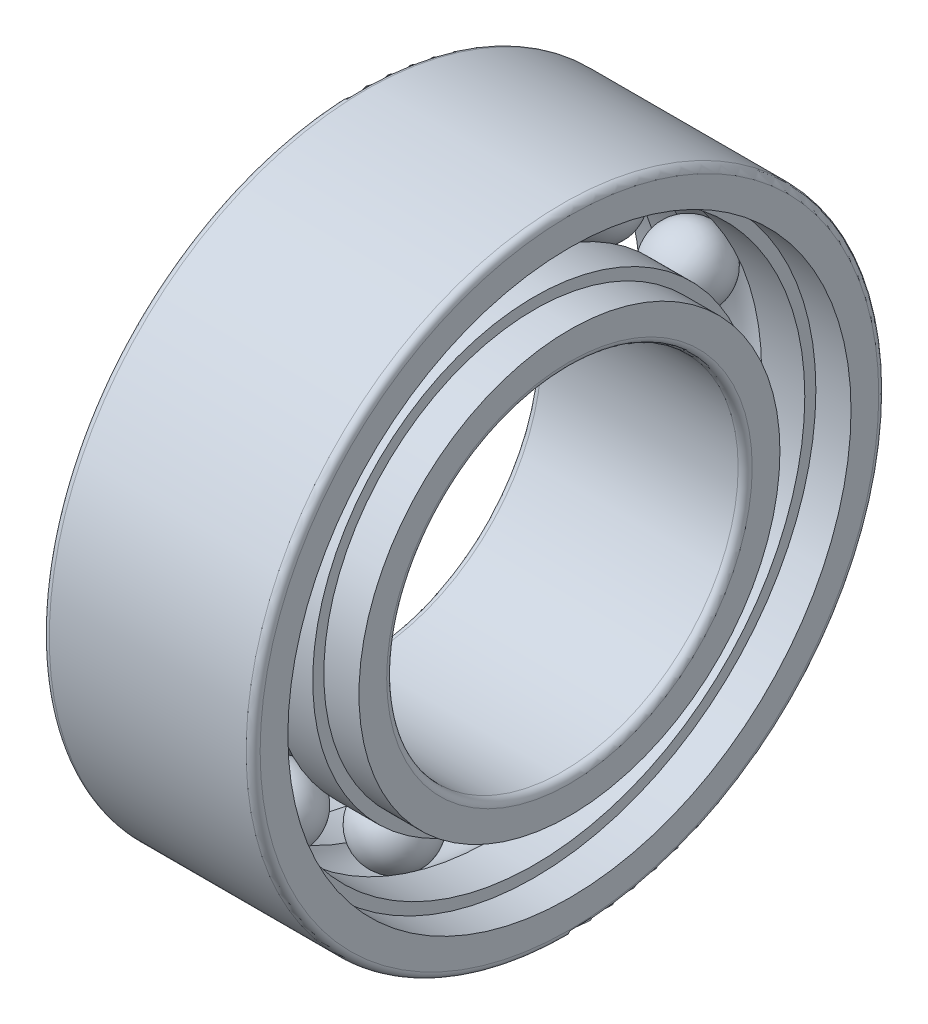
ISO-10303-21;
HEADER;
FILE_DESCRIPTION(('STEP AP214'),'2;1');
FILE_NAME('part.step','',(''),(''),'','','');
FILE_SCHEMA(('AUTOMOTIVE_DESIGN { 1 0 10303 214 1 1 1 1 }'));
ENDSEC;
DATA;
#1=APPLICATION_CONTEXT('core data for automotive mechanical design processes');
#2=APPLICATION_PROTOCOL_DEFINITION('international standard','automotive_design',2000,#1);
#3=PRODUCT_CONTEXT('',#1,'mechanical');
#4=PRODUCT('Part','Part','',(#3));
#5=PRODUCT_RELATED_PRODUCT_CATEGORY('part','',(#4));
#6=PRODUCT_DEFINITION_FORMATION('','',#4);
#7=PRODUCT_DEFINITION_CONTEXT('part definition',#1,'design');
#8=PRODUCT_DEFINITION('design','',#6,#7);
#9=PRODUCT_DEFINITION_SHAPE('','',#8);
#10=(LENGTH_UNIT() NAMED_UNIT(*) SI_UNIT(.MILLI.,.METRE.));
#11=(NAMED_UNIT(*) PLANE_ANGLE_UNIT() SI_UNIT($,.RADIAN.));
#12=(NAMED_UNIT(*) SI_UNIT($,.STERADIAN.) SOLID_ANGLE_UNIT());
#13=UNCERTAINTY_MEASURE_WITH_UNIT(LENGTH_MEASURE(1.E-05),#10,'distance_accuracy_value','');
#14=(GEOMETRIC_REPRESENTATION_CONTEXT(3) GLOBAL_UNCERTAINTY_ASSIGNED_CONTEXT((#13)) GLOBAL_UNIT_ASSIGNED_CONTEXT((#10,
#11,#12)) REPRESENTATION_CONTEXT('',''));
#15=CARTESIAN_POINT('',(0.,0.,0.));
#16=DIRECTION('',(0.,0.,1.));
#17=DIRECTION('',(1.,0.,0.));
#18=AXIS2_PLACEMENT_3D('',#15,#16,#17);
#19=CARTESIAN_POINT('',(1.5,-3.35822540765074,0.986063948945004));
#20=DIRECTION('',(1.,0.,0.));
#21=DIRECTION('',(0.,-0.959492973614497,0.28173255684143));
#22=AXIS2_PLACEMENT_3D('',#19,#20,#21);
#23=SPHERICAL_SURFACE('',#22,0.52);
#24=CARTESIAN_POINT('',(0.98,-3.35822540765074,0.986063948945004));
#25=VERTEX_POINT('',#24);
#26=VERTEX_LOOP('',#25);
#27=FACE_BOUND('',#26,.T.);
#28=CARTESIAN_POINT('',(2.02,-3.35822540765074,0.986063948945004));
#29=VERTEX_POINT('',#28);
#30=VERTEX_LOOP('',#29);
#31=FACE_BOUND('',#30,.T.);
#32=ADVANCED_FACE('P0_F16',(#27,#31),#23,.T.);
#33=OPEN_SHELL('',(#32));
#34=SHELL_BASED_SURFACE_MODEL('P0_B1',(#33));
#35=CARTESIAN_POINT('',(1.5,1.4539525455066,-3.18371198374082));
#36=DIRECTION('',(1.,0.,0.));
#37=DIRECTION('',(0.,0.415415013001886,-0.909631995354519));
#38=AXIS2_PLACEMENT_3D('',#35,#36,#37);
#39=SPHERICAL_SURFACE('',#38,0.52);
#40=CARTESIAN_POINT('',(0.98,1.4539525455066,-3.18371198374082));
#41=VERTEX_POINT('',#40);
#42=VERTEX_LOOP('',#41);
#43=FACE_BOUND('',#42,.T.);
#44=CARTESIAN_POINT('',(2.02,1.4539525455066,-3.18371198374082));
#45=VERTEX_POINT('',#44);
#46=VERTEX_LOOP('',#45);
#47=FACE_BOUND('',#46,.T.);
#48=ADVANCED_FACE('P1_F16',(#43,#47),#39,.T.);
#49=OPEN_SHELL('',(#48));
#50=SHELL_BASED_SURFACE_MODEL('P1_B1',(#49));
#51=CARTESIAN_POINT('',(1.5,2.94438736490914,-1.89224286109459));
#52=DIRECTION('',(1.,0.,0.));
#53=DIRECTION('',(0.,0.841253532831181,-0.540640817455598));
#54=AXIS2_PLACEMENT_3D('',#51,#52,#53);
#55=SPHERICAL_SURFACE('',#54,0.52);
#56=CARTESIAN_POINT('',(0.98,2.94438736490914,-1.89224286109459));
#57=VERTEX_POINT('',#56);
#58=VERTEX_LOOP('',#57);
#59=FACE_BOUND('',#58,.T.);
#60=CARTESIAN_POINT('',(2.02,2.94438736490914,-1.89224286109459));
#61=VERTEX_POINT('',#60);
#62=VERTEX_LOOP('',#61);
#63=FACE_BOUND('',#62,.T.);
#64=ADVANCED_FACE('P2_F16',(#59,#63),#55,.T.);
#65=OPEN_SHELL('',(#64));
#66=SHELL_BASED_SURFACE_MODEL('P2_B1',(#65));
#67=CARTESIAN_POINT('',(1.5,0.,0.));
#68=DIRECTION('',(1.,0.,0.));
#69=DIRECTION('',(0.,0.,-1.));
#70=AXIS2_PLACEMENT_3D('',#67,#68,#69);
#71=TOROIDAL_SURFACE('',#70,3.5,0.52);
#72=CARTESIAN_POINT('',(1.11361159437685,0.,0.));
#73=DIRECTION('',(1.,0.,0.));
#74=DIRECTION('',(0.,0.,-1.));
#75=AXIS2_PLACEMENT_3D('',#72,#73,#74);
#76=CIRCLE('',#75,3.848);
#77=CARTESIAN_POINT('',(1.11361159437685,0.,-3.848));
#78=VERTEX_POINT('',#77);
#79=EDGE_CURVE('P3_E144',#78,#78,#76,.F.);
#80=ORIENTED_EDGE('',*,*,#79,.T.);
#81=EDGE_LOOP('',(#80));
#82=FACE_BOUND('',#81,.T.);
#83=CARTESIAN_POINT('',(1.88638840562315,0.,0.));
#84=DIRECTION('',(1.,0.,0.));
#85=DIRECTION('',(0.,0.,-1.));
#86=AXIS2_PLACEMENT_3D('',#83,#84,#85);
#87=CIRCLE('',#86,3.84800000000001);
#88=CARTESIAN_POINT('',(1.88638840562315,0.,-3.84800000000001));
#89=VERTEX_POINT('',#88);
#90=EDGE_CURVE('P3_E141',#89,#89,#87,.T.);
#91=ORIENTED_EDGE('',*,*,#90,.T.);
#92=EDGE_LOOP('',(#91));
#93=FACE_BOUND('',#92,.T.);
#94=ADVANCED_FACE('P3_F15',(#82,#93),#71,.F.);
#95=CARTESIAN_POINT('',(0.806805797188427,0.,0.));
#96=DIRECTION('',(1.,0.,0.));
#97=DIRECTION('',(0.,0.,-1.));
#98=AXIS2_PLACEMENT_3D('',#95,#96,#97);
#99=CYLINDRICAL_SURFACE('',#98,3.848);
#100=ORIENTED_EDGE('',*,*,#79,.F.);
#101=EDGE_LOOP('',(#100));
#102=FACE_BOUND('',#101,.T.);
#103=CARTESIAN_POINT('',(0.500000000000002,0.,0.));
#104=DIRECTION('',(1.,0.,0.));
#105=DIRECTION('',(0.,0.,-1.));
#106=AXIS2_PLACEMENT_3D('',#103,#104,#105);
#107=CIRCLE('',#106,3.848);
#108=CARTESIAN_POINT('',(0.500000000000002,0.,-3.848));
#109=VERTEX_POINT('',#108);
#110=EDGE_CURVE('P3_E19',#109,#109,#107,.T.);
#111=ORIENTED_EDGE('',*,*,#110,.F.);
#112=EDGE_LOOP('',(#111));
#113=FACE_BOUND('',#112,.T.);
#114=ADVANCED_FACE('P3_F102',(#102,#113),#99,.F.);
#115=CARTESIAN_POINT('',(2.19319420281158,0.,0.));
#116=DIRECTION('',(1.,0.,0.));
#117=DIRECTION('',(0.,0.,-1.));
#118=AXIS2_PLACEMENT_3D('',#115,#116,#117);
#119=CYLINDRICAL_SURFACE('',#118,3.84800000000001);
#120=CARTESIAN_POINT('',(2.50000000000001,0.,0.));
#121=DIRECTION('',(1.,0.,0.));
#122=DIRECTION('',(0.,0.,-1.));
#123=AXIS2_PLACEMENT_3D('',#120,#121,#122);
#124=CIRCLE('',#123,3.84800000000001);
#125=CARTESIAN_POINT('',(2.50000000000001,0.,-3.84800000000001));
#126=VERTEX_POINT('',#125);
#127=EDGE_CURVE('P3_E137',#126,#126,#124,.F.);
#128=ORIENTED_EDGE('',*,*,#127,.F.);
#129=EDGE_LOOP('',(#128));
#130=FACE_BOUND('',#129,.T.);
#131=ORIENTED_EDGE('',*,*,#90,.F.);
#132=EDGE_LOOP('',(#131));
#133=FACE_BOUND('',#132,.T.);
#134=ADVANCED_FACE('P3_F99',(#130,#133),#119,.F.);
#135=CARTESIAN_POINT('',(0.500000000000002,3.9268,0.));
#136=DIRECTION('',(-1.,0.,0.));
#137=DIRECTION('',(0.,0.,1.));
#138=AXIS2_PLACEMENT_3D('',#135,#136,#137);
#139=PLANE('',#138);
#140=ORIENTED_EDGE('',*,*,#110,.T.);
#141=EDGE_LOOP('',(#140));
#142=FACE_BOUND('',#141,.T.);
#143=CARTESIAN_POINT('',(0.500000000000002,0.,0.));
#144=DIRECTION('',(1.,0.,0.));
#145=DIRECTION('',(0.,0.,-1.));
#146=AXIS2_PLACEMENT_3D('',#143,#144,#145);
#147=CIRCLE('',#146,4.0056);
#148=CARTESIAN_POINT('',(0.500000000000002,0.,-4.0056));
#149=VERTEX_POINT('',#148);
#150=EDGE_CURVE('P3_E135',#149,#149,#147,.F.);
#151=ORIENTED_EDGE('',*,*,#150,.T.);
#152=EDGE_LOOP('',(#151));
#153=FACE_BOUND('',#152,.T.);
#154=ADVANCED_FACE('P3_F95',(#142,#153),#139,.T.);
#155=CARTESIAN_POINT('',(2.50000000000001,3.9268,0.));
#156=DIRECTION('',(1.,0.,0.));
#157=DIRECTION('',(0.,0.,-1.));
#158=AXIS2_PLACEMENT_3D('',#155,#156,#157);
#159=PLANE('',#158);
#160=ORIENTED_EDGE('',*,*,#127,.T.);
#161=EDGE_LOOP('',(#160));
#162=FACE_BOUND('',#161,.T.);
#163=CARTESIAN_POINT('',(2.50000000000001,0.,0.));
#164=DIRECTION('',(1.,0.,0.));
#165=DIRECTION('',(0.,0.,-1.));
#166=AXIS2_PLACEMENT_3D('',#163,#164,#165);
#167=CIRCLE('',#166,4.0056);
#168=CARTESIAN_POINT('',(2.50000000000001,0.,-4.0056));
#169=VERTEX_POINT('',#168);
#170=EDGE_CURVE('P3_E128',#169,#169,#167,.T.);
#171=ORIENTED_EDGE('',*,*,#170,.T.);
#172=EDGE_LOOP('',(#171));
#173=FACE_BOUND('',#172,.T.);
#174=ADVANCED_FACE('P3_F91',(#162,#173),#159,.T.);
#175=CARTESIAN_POINT('',(0.250000000000001,0.,0.));
#176=DIRECTION('',(1.,0.,0.));
#177=DIRECTION('',(0.,0.,-1.));
#178=AXIS2_PLACEMENT_3D('',#175,#176,#177);
#179=CYLINDRICAL_SURFACE('',#178,4.0056);
#180=ORIENTED_EDGE('',*,*,#150,.F.);
#181=EDGE_LOOP('',(#180));
#182=FACE_BOUND('',#181,.T.);
#183=CARTESIAN_POINT('',(0.,0.,0.));
#184=DIRECTION('',(1.,0.,0.));
#185=DIRECTION('',(0.,0.,-1.));
#186=AXIS2_PLACEMENT_3D('',#183,#184,#185);
#187=CIRCLE('',#186,4.0056);
#188=CARTESIAN_POINT('',(0.,0.,-4.0056));
#189=VERTEX_POINT('',#188);
#190=EDGE_CURVE('P3_E123',#189,#189,#187,.T.);
#191=ORIENTED_EDGE('',*,*,#190,.F.);
#192=EDGE_LOOP('',(#191));
#193=FACE_BOUND('',#192,.T.);
#194=ADVANCED_FACE('P3_F87',(#182,#193),#179,.F.);
#195=CARTESIAN_POINT('',(2.75000000000001,0.,0.));
#196=DIRECTION('',(1.,0.,0.));
#197=DIRECTION('',(0.,0.,-1.));
#198=AXIS2_PLACEMENT_3D('',#195,#196,#197);
#199=CYLINDRICAL_SURFACE('',#198,4.0056);
#200=CARTESIAN_POINT('',(3.00000000000001,0.,0.));
#201=DIRECTION('',(1.,0.,0.));
#202=DIRECTION('',(0.,0.,-1.));
#203=AXIS2_PLACEMENT_3D('',#200,#201,#202);
#204=CIRCLE('',#203,4.0056);
#205=CARTESIAN_POINT('',(3.00000000000001,0.,-4.0056));
#206=VERTEX_POINT('',#205);
#207=EDGE_CURVE('P3_E121',#206,#206,#204,.F.);
#208=ORIENTED_EDGE('',*,*,#207,.F.);
#209=EDGE_LOOP('',(#208));
#210=FACE_BOUND('',#209,.T.);
#211=ORIENTED_EDGE('',*,*,#170,.F.);
#212=EDGE_LOOP('',(#211));
#213=FACE_BOUND('',#212,.T.);
#214=ADVANCED_FACE('P3_F82',(#210,#213),#199,.F.);
#215=CARTESIAN_POINT('',(0.,4.2528,0.));
#216=DIRECTION('',(-1.,0.,0.));
#217=DIRECTION('',(0.,0.,1.));
#218=AXIS2_PLACEMENT_3D('',#215,#216,#217);
#219=PLANE('',#218);
#220=ORIENTED_EDGE('',*,*,#190,.T.);
#221=EDGE_LOOP('',(#220));
#222=FACE_BOUND('',#221,.T.);
#223=CARTESIAN_POINT('',(0.,0.,0.));
#224=DIRECTION('',(1.,0.,0.));
#225=DIRECTION('',(0.,1.,0.));
#226=AXIS2_PLACEMENT_3D('',#223,#224,#225);
#227=CIRCLE('',#226,4.4);
#228=CARTESIAN_POINT('',(0.,4.4,0.));
#229=VERTEX_POINT('',#228);
#230=EDGE_CURVE('P3_E66',#229,#229,#227,.T.);
#231=ORIENTED_EDGE('',*,*,#230,.F.);
#232=EDGE_LOOP('',(#231));
#233=FACE_BOUND('',#232,.T.);
#234=ADVANCED_FACE('P3_F72',(#222,#233),#219,.T.);
#235=CARTESIAN_POINT('',(3.00000000000001,4.2528,0.));
#236=DIRECTION('',(1.,0.,0.));
#237=DIRECTION('',(0.,0.,-1.));
#238=AXIS2_PLACEMENT_3D('',#235,#236,#237);
#239=PLANE('',#238);
#240=ORIENTED_EDGE('',*,*,#207,.T.);
#241=EDGE_LOOP('',(#240));
#242=FACE_BOUND('',#241,.T.);
#243=CARTESIAN_POINT('',(3.00000000000001,0.,0.));
#244=DIRECTION('',(-1.,0.,0.));
#245=DIRECTION('',(0.,1.,0.));
#246=AXIS2_PLACEMENT_3D('',#243,#244,#245);
#247=CIRCLE('',#246,4.4);
#248=CARTESIAN_POINT('',(3.00000000000001,4.4,0.));
#249=VERTEX_POINT('',#248);
#250=EDGE_CURVE('P3_E28',#249,#249,#247,.T.);
#251=ORIENTED_EDGE('',*,*,#250,.F.);
#252=EDGE_LOOP('',(#251));
#253=FACE_BOUND('',#252,.T.);
#254=ADVANCED_FACE('P3_F81',(#242,#253),#239,.T.);
#255=CARTESIAN_POINT('',(0.0999999999999998,0.,0.));
#256=DIRECTION('',(1.,0.,0.));
#257=DIRECTION('',(0.,0.,-1.));
#258=AXIS2_PLACEMENT_3D('',#255,#256,#257);
#259=TOROIDAL_SURFACE('',#258,4.4,0.1);
#260=CARTESIAN_POINT('',(0.0999999999999998,0.,0.));
#261=DIRECTION('',(1.,0.,0.));
#262=DIRECTION('',(0.,0.,-1.));
#263=AXIS2_PLACEMENT_3D('',#260,#261,#262);
#264=CIRCLE('',#263,4.5);
#265=CARTESIAN_POINT('',(0.0999999999999998,0.,-4.5));
#266=VERTEX_POINT('',#265);
#267=EDGE_CURVE('P3_E23',#266,#266,#264,.T.);
#268=ORIENTED_EDGE('',*,*,#267,.F.);
#269=EDGE_LOOP('',(#268));
#270=FACE_BOUND('',#269,.T.);
#271=ORIENTED_EDGE('',*,*,#230,.T.);
#272=EDGE_LOOP('',(#271));
#273=FACE_BOUND('',#272,.T.);
#274=ADVANCED_FACE('P3_F46',(#270,#273),#259,.T.);
#275=CARTESIAN_POINT('',(2.90000000000001,0.,0.));
#276=DIRECTION('',(1.,0.,0.));
#277=DIRECTION('',(0.,0.,-1.));
#278=AXIS2_PLACEMENT_3D('',#275,#276,#277);
#279=TOROIDAL_SURFACE('',#278,4.4,0.1);
#280=ORIENTED_EDGE('',*,*,#250,.T.);
#281=EDGE_LOOP('',(#280));
#282=FACE_BOUND('',#281,.T.);
#283=CARTESIAN_POINT('',(2.90000000000001,0.,0.));
#284=DIRECTION('',(1.,0.,0.));
#285=DIRECTION('',(0.,0.,-1.));
#286=AXIS2_PLACEMENT_3D('',#283,#284,#285);
#287=CIRCLE('',#286,4.5);
#288=CARTESIAN_POINT('',(2.90000000000001,0.,-4.5));
#289=VERTEX_POINT('',#288);
#290=EDGE_CURVE('P3_E10',#289,#289,#287,.F.);
#291=ORIENTED_EDGE('',*,*,#290,.F.);
#292=EDGE_LOOP('',(#291));
#293=FACE_BOUND('',#292,.T.);
#294=ADVANCED_FACE('P3_F40',(#282,#293),#279,.T.);
#295=CARTESIAN_POINT('',(2.00000000000001,0.,0.));
#296=DIRECTION('',(1.,0.,0.));
#297=DIRECTION('',(0.,0.,-1.));
#298=AXIS2_PLACEMENT_3D('',#295,#296,#297);
#299=CYLINDRICAL_SURFACE('',#298,4.5);
#300=ORIENTED_EDGE('',*,*,#290,.T.);
#301=EDGE_LOOP('',(#300));
#302=FACE_BOUND('',#301,.T.);
#303=ORIENTED_EDGE('',*,*,#267,.T.);
#304=EDGE_LOOP('',(#303));
#305=FACE_BOUND('',#304,.T.);
#306=ADVANCED_FACE('P3_F45',(#302,#305),#299,.T.);
#307=CLOSED_SHELL('',(#94,#114,#134,#154,#174,#194,#214,#234,#254,#274,#294,#306));
#308=MANIFOLD_SOLID_BREP('P3_B1',#307);
#309=CARTESIAN_POINT('',(1.5,-0.498101933956498,-3.46437504658327));
#310=DIRECTION('',(1.,0.,0.));
#311=DIRECTION('',(0.,-0.142314838273285,-0.989821441880933));
#312=AXIS2_PLACEMENT_3D('',#309,#310,#311);
#313=SPHERICAL_SURFACE('',#312,0.52);
#314=CARTESIAN_POINT('',(0.98,-0.498101933956498,-3.46437504658327));
#315=VERTEX_POINT('',#314);
#316=VERTEX_LOOP('',#315);
#317=FACE_BOUND('',#316,.T.);
#318=CARTESIAN_POINT('',(2.02,-0.498101933956498,-3.46437504658327));
#319=VERTEX_POINT('',#318);
#320=VERTEX_LOOP('',#319);
#321=FACE_BOUND('',#320,.T.);
#322=ADVANCED_FACE('P4_F16',(#317,#321),#313,.T.);
#323=OPEN_SHELL('',(#322));
#324=SHELL_BASED_SURFACE_MODEL('P4_B1',(#323));
#325=CARTESIAN_POINT('',(1.5,0.,0.));
#326=DIRECTION('',(1.,0.,0.));
#327=DIRECTION('',(0.,0.,-1.));
#328=AXIS2_PLACEMENT_3D('',#325,#326,#327);
#329=TOROIDAL_SURFACE('',#328,3.5,0.52);
#330=CARTESIAN_POINT('',(1.11361159437685,0.,0.));
#331=DIRECTION('',(1.,0.,0.));
#332=DIRECTION('',(0.,0.,-1.));
#333=AXIS2_PLACEMENT_3D('',#330,#331,#332);
#334=CIRCLE('',#333,3.152);
#335=CARTESIAN_POINT('',(1.11361159437685,0.,-3.152));
#336=VERTEX_POINT('',#335);
#337=EDGE_CURVE('P5_E142',#336,#336,#334,.F.);
#338=ORIENTED_EDGE('',*,*,#337,.F.);
#339=EDGE_LOOP('',(#338));
#340=FACE_BOUND('',#339,.T.);
#341=CARTESIAN_POINT('',(1.88638840562315,0.,0.));
#342=DIRECTION('',(1.,0.,0.));
#343=DIRECTION('',(0.,0.,-1.));
#344=AXIS2_PLACEMENT_3D('',#341,#342,#343);
#345=CIRCLE('',#344,3.152);
#346=CARTESIAN_POINT('',(1.88638840562315,0.,-3.152));
#347=VERTEX_POINT('',#346);
#348=EDGE_CURVE('P5_E146',#347,#347,#345,.T.);
#349=ORIENTED_EDGE('',*,*,#348,.F.);
#350=EDGE_LOOP('',(#349));
#351=FACE_BOUND('',#350,.T.);
#352=ADVANCED_FACE('P5_F15',(#340,#351),#329,.F.);
#353=CARTESIAN_POINT('',(2.19319420281158,0.,0.));
#354=DIRECTION('',(1.,0.,0.));
#355=DIRECTION('',(0.,0.,-1.));
#356=AXIS2_PLACEMENT_3D('',#353,#354,#355);
#357=CYLINDRICAL_SURFACE('',#356,3.152);
#358=ORIENTED_EDGE('',*,*,#348,.T.);
#359=EDGE_LOOP('',(#358));
#360=FACE_BOUND('',#359,.T.);
#361=CARTESIAN_POINT('',(2.50000000000001,0.,0.));
#362=DIRECTION('',(1.,0.,0.));
#363=DIRECTION('',(0.,0.,-1.));
#364=AXIS2_PLACEMENT_3D('',#361,#362,#363);
#365=CIRCLE('',#364,3.152);
#366=CARTESIAN_POINT('',(2.50000000000001,0.,-3.152));
#367=VERTEX_POINT('',#366);
#368=EDGE_CURVE('P5_E19',#367,#367,#365,.T.);
#369=ORIENTED_EDGE('',*,*,#368,.F.);
#370=EDGE_LOOP('',(#369));
#371=FACE_BOUND('',#370,.T.);
#372=ADVANCED_FACE('P5_F101',(#360,#371),#357,.T.);
#373=CARTESIAN_POINT('',(0.806805797188427,0.,0.));
#374=DIRECTION('',(1.,0.,0.));
#375=DIRECTION('',(0.,0.,-1.));
#376=AXIS2_PLACEMENT_3D('',#373,#374,#375);
#377=CYLINDRICAL_SURFACE('',#376,3.152);
#378=CARTESIAN_POINT('',(0.500000000000003,0.,0.));
#379=DIRECTION('',(1.,0.,0.));
#380=DIRECTION('',(0.,0.,-1.));
#381=AXIS2_PLACEMENT_3D('',#378,#379,#380);
#382=CIRCLE('',#381,3.152);
#383=CARTESIAN_POINT('',(0.500000000000003,0.,-3.152));
#384=VERTEX_POINT('',#383);
#385=EDGE_CURVE('P5_E137',#384,#384,#382,.F.);
#386=ORIENTED_EDGE('',*,*,#385,.F.);
#387=EDGE_LOOP('',(#386));
#388=FACE_BOUND('',#387,.T.);
#389=ORIENTED_EDGE('',*,*,#337,.T.);
#390=EDGE_LOOP('',(#389));
#391=FACE_BOUND('',#390,.T.);
#392=ADVANCED_FACE('P5_F98',(#388,#391),#377,.T.);
#393=CARTESIAN_POINT('',(2.50000000000001,3.0732,0.));
#394=DIRECTION('',(1.,0.,0.));
#395=DIRECTION('',(0.,0.,-1.));
#396=AXIS2_PLACEMENT_3D('',#393,#394,#395);
#397=PLANE('',#396);
#398=CARTESIAN_POINT('',(2.50000000000001,0.,0.));
#399=DIRECTION('',(1.,0.,0.));
#400=DIRECTION('',(0.,0.,-1.));
#401=AXIS2_PLACEMENT_3D('',#398,#399,#400);
#402=CIRCLE('',#401,2.9944);
#403=CARTESIAN_POINT('',(2.50000000000001,0.,-2.9944));
#404=VERTEX_POINT('',#403);
#405=EDGE_CURVE('P5_E135',#404,#404,#402,.T.);
#406=ORIENTED_EDGE('',*,*,#405,.F.);
#407=EDGE_LOOP('',(#406));
#408=FACE_BOUND('',#407,.T.);
#409=ORIENTED_EDGE('',*,*,#368,.T.);
#410=EDGE_LOOP('',(#409));
#411=FACE_BOUND('',#410,.T.);
#412=ADVANCED_FACE('P5_F94',(#408,#411),#397,.T.);
#413=CARTESIAN_POINT('',(0.500000000000003,3.0732,0.));
#414=DIRECTION('',(-1.,0.,0.));
#415=DIRECTION('',(0.,0.,1.));
#416=AXIS2_PLACEMENT_3D('',#413,#414,#415);
#417=PLANE('',#416);
#418=CARTESIAN_POINT('',(0.500000000000003,0.,0.));
#419=DIRECTION('',(1.,0.,0.));
#420=DIRECTION('',(0.,0.,-1.));
#421=AXIS2_PLACEMENT_3D('',#418,#419,#420);
#422=CIRCLE('',#421,2.9944);
#423=CARTESIAN_POINT('',(0.500000000000003,0.,-2.9944));
#424=VERTEX_POINT('',#423);
#425=EDGE_CURVE('P5_E128',#424,#424,#422,.F.);
#426=ORIENTED_EDGE('',*,*,#425,.F.);
#427=EDGE_LOOP('',(#426));
#428=FACE_BOUND('',#427,.T.);
#429=ORIENTED_EDGE('',*,*,#385,.T.);
#430=EDGE_LOOP('',(#429));
#431=FACE_BOUND('',#430,.T.);
#432=ADVANCED_FACE('P5_F90',(#428,#431),#417,.T.);
#433=CARTESIAN_POINT('',(2.75000000000001,0.,0.));
#434=DIRECTION('',(1.,0.,0.));
#435=DIRECTION('',(0.,0.,-1.));
#436=AXIS2_PLACEMENT_3D('',#433,#434,#435);
#437=CYLINDRICAL_SURFACE('',#436,2.9944);
#438=ORIENTED_EDGE('',*,*,#405,.T.);
#439=EDGE_LOOP('',(#438));
#440=FACE_BOUND('',#439,.T.);
#441=CARTESIAN_POINT('',(3.00000000000001,0.,0.));
#442=DIRECTION('',(1.,0.,0.));
#443=DIRECTION('',(0.,0.,-1.));
#444=AXIS2_PLACEMENT_3D('',#441,#442,#443);
#445=CIRCLE('',#444,2.9944);
#446=CARTESIAN_POINT('',(3.00000000000001,0.,-2.9944));
#447=VERTEX_POINT('',#446);
#448=EDGE_CURVE('P5_E123',#447,#447,#445,.T.);
#449=ORIENTED_EDGE('',*,*,#448,.F.);
#450=EDGE_LOOP('',(#449));
#451=FACE_BOUND('',#450,.T.);
#452=ADVANCED_FACE('P5_F86',(#440,#451),#437,.T.);
#453=CARTESIAN_POINT('',(0.250000000000001,0.,0.));
#454=DIRECTION('',(1.,0.,0.));
#455=DIRECTION('',(0.,0.,-1.));
#456=AXIS2_PLACEMENT_3D('',#453,#454,#455);
#457=CYLINDRICAL_SURFACE('',#456,2.9944);
#458=CARTESIAN_POINT('',(0.,0.,0.));
#459=DIRECTION('',(1.,0.,0.));
#460=DIRECTION('',(0.,0.,-1.));
#461=AXIS2_PLACEMENT_3D('',#458,#459,#460);
#462=CIRCLE('',#461,2.9944);
#463=CARTESIAN_POINT('',(0.,0.,-2.9944));
#464=VERTEX_POINT('',#463);
#465=EDGE_CURVE('P5_E121',#464,#464,#462,.F.);
#466=ORIENTED_EDGE('',*,*,#465,.F.);
#467=EDGE_LOOP('',(#466));
#468=FACE_BOUND('',#467,.T.);
#469=ORIENTED_EDGE('',*,*,#425,.T.);
#470=EDGE_LOOP('',(#469));
#471=FACE_BOUND('',#470,.T.);
#472=ADVANCED_FACE('P5_F82',(#468,#471),#457,.T.);
#473=CARTESIAN_POINT('',(3.00000000000001,2.7472,0.));
#474=DIRECTION('',(1.,0.,0.));
#475=DIRECTION('',(0.,0.,-1.));
#476=AXIS2_PLACEMENT_3D('',#473,#474,#475);
#477=PLANE('',#476);
#478=CARTESIAN_POINT('',(3.00000000000001,0.,0.));
#479=DIRECTION('',(1.,0.,0.));
#480=DIRECTION('',(0.,1.,0.));
#481=AXIS2_PLACEMENT_3D('',#478,#479,#480);
#482=CIRCLE('',#481,2.6);
#483=CARTESIAN_POINT('',(3.00000000000001,2.6,0.));
#484=VERTEX_POINT('',#483);
#485=EDGE_CURVE('P5_E66',#484,#484,#482,.T.);
#486=ORIENTED_EDGE('',*,*,#485,.F.);
#487=EDGE_LOOP('',(#486));
#488=FACE_BOUND('',#487,.T.);
#489=ORIENTED_EDGE('',*,*,#448,.T.);
#490=EDGE_LOOP('',(#489));
#491=FACE_BOUND('',#490,.T.);
#492=ADVANCED_FACE('P5_F72',(#488,#491),#477,.T.);
#493=CARTESIAN_POINT('',(0.,2.7472,0.));
#494=DIRECTION('',(-1.,0.,0.));
#495=DIRECTION('',(0.,0.,1.));
#496=AXIS2_PLACEMENT_3D('',#493,#494,#495);
#497=PLANE('',#496);
#498=CARTESIAN_POINT('',(0.,0.,0.));
#499=DIRECTION('',(-1.,0.,0.));
#500=DIRECTION('',(0.,1.,0.));
#501=AXIS2_PLACEMENT_3D('',#498,#499,#500);
#502=CIRCLE('',#501,2.6);
#503=CARTESIAN_POINT('',(0.,2.6,0.));
#504=VERTEX_POINT('',#503);
#505=EDGE_CURVE('P5_E28',#504,#504,#502,.T.);
#506=ORIENTED_EDGE('',*,*,#505,.F.);
#507=EDGE_LOOP('',(#506));
#508=FACE_BOUND('',#507,.T.);
#509=ORIENTED_EDGE('',*,*,#465,.T.);
#510=EDGE_LOOP('',(#509));
#511=FACE_BOUND('',#510,.T.);
#512=ADVANCED_FACE('P5_F81',(#508,#511),#497,.T.);
#513=CARTESIAN_POINT('',(2.90000000000001,0.,0.));
#514=DIRECTION('',(1.,0.,0.));
#515=DIRECTION('',(0.,0.,-1.));
#516=AXIS2_PLACEMENT_3D('',#513,#514,#515);
#517=TOROIDAL_SURFACE('',#516,2.6,0.1);
#518=CARTESIAN_POINT('',(2.90000000000001,0.,0.));
#519=DIRECTION('',(1.,0.,0.));
#520=DIRECTION('',(0.,0.,-1.));
#521=AXIS2_PLACEMENT_3D('',#518,#519,#520);
#522=CIRCLE('',#521,2.5);
#523=CARTESIAN_POINT('',(2.90000000000001,0.,-2.5));
#524=VERTEX_POINT('',#523);
#525=EDGE_CURVE('P5_E23',#524,#524,#522,.F.);
#526=ORIENTED_EDGE('',*,*,#525,.T.);
#527=EDGE_LOOP('',(#526));
#528=FACE_BOUND('',#527,.T.);
#529=ORIENTED_EDGE('',*,*,#485,.T.);
#530=EDGE_LOOP('',(#529));
#531=FACE_BOUND('',#530,.T.);
#532=ADVANCED_FACE('P5_F46',(#528,#531),#517,.T.);
#533=CARTESIAN_POINT('',(0.1,0.,0.));
#534=DIRECTION('',(1.,0.,0.));
#535=DIRECTION('',(0.,0.,-1.));
#536=AXIS2_PLACEMENT_3D('',#533,#534,#535);
#537=TOROIDAL_SURFACE('',#536,2.6,0.1);
#538=ORIENTED_EDGE('',*,*,#505,.T.);
#539=EDGE_LOOP('',(#538));
#540=FACE_BOUND('',#539,.T.);
#541=CARTESIAN_POINT('',(0.1,0.,0.));
#542=DIRECTION('',(1.,0.,0.));
#543=DIRECTION('',(0.,0.,-1.));
#544=AXIS2_PLACEMENT_3D('',#541,#542,#543);
#545=CIRCLE('',#544,2.5);
#546=CARTESIAN_POINT('',(0.1,0.,-2.5));
#547=VERTEX_POINT('',#546);
#548=EDGE_CURVE('P5_E10',#547,#547,#545,.T.);
#549=ORIENTED_EDGE('',*,*,#548,.T.);
#550=EDGE_LOOP('',(#549));
#551=FACE_BOUND('',#550,.T.);
#552=ADVANCED_FACE('P5_F40',(#540,#551),#537,.T.);
#553=CARTESIAN_POINT('',(1.5,0.,0.));
#554=DIRECTION('',(1.,0.,0.));
#555=DIRECTION('',(0.,0.,-1.));
#556=AXIS2_PLACEMENT_3D('',#553,#554,#555);
#557=CYLINDRICAL_SURFACE('',#556,2.5);
#558=ORIENTED_EDGE('',*,*,#548,.F.);
#559=EDGE_LOOP('',(#558));
#560=FACE_BOUND('',#559,.T.);
#561=ORIENTED_EDGE('',*,*,#525,.F.);
#562=EDGE_LOOP('',(#561));
#563=FACE_BOUND('',#562,.T.);
#564=ADVANCED_FACE('P5_F45',(#560,#563),#557,.F.);
#565=CLOSED_SHELL('',(#352,#372,#392,#412,#432,#452,#472,#492,#512,#532,#552,#564));
#566=MANIFOLD_SOLID_BREP('P5_B1',#565);
#567=CARTESIAN_POINT('',(1.5,2.94438736490914,1.89224286109459));
#568=DIRECTION('',(1.,0.,0.));
#569=DIRECTION('',(0.,0.841253532831181,0.540640817455598));
#570=AXIS2_PLACEMENT_3D('',#567,#568,#569);
#571=SPHERICAL_SURFACE('',#570,0.52);
#572=CARTESIAN_POINT('',(0.98,2.94438736490914,1.89224286109459));
#573=VERTEX_POINT('',#572);
#574=VERTEX_LOOP('',#573);
#575=FACE_BOUND('',#574,.T.);
#576=CARTESIAN_POINT('',(2.02,2.94438736490914,1.89224286109459));
#577=VERTEX_POINT('',#576);
#578=VERTEX_LOOP('',#577);
#579=FACE_BOUND('',#578,.T.);
#580=ADVANCED_FACE('P6_F16',(#575,#579),#571,.T.);
#581=OPEN_SHELL('',(#580));
#582=SHELL_BASED_SURFACE_MODEL('P6_B1',(#581));
#583=CARTESIAN_POINT('',(1.5,3.5,0.));
#584=DIRECTION('',(1.,0.,0.));
#585=DIRECTION('',(0.,1.,0.));
#586=AXIS2_PLACEMENT_3D('',#583,#584,#585);
#587=SPHERICAL_SURFACE('',#586,0.52);
#588=CARTESIAN_POINT('',(0.98,3.5,0.));
#589=VERTEX_POINT('',#588);
#590=VERTEX_LOOP('',#589);
#591=FACE_BOUND('',#590,.T.);
#592=CARTESIAN_POINT('',(2.02,3.5,0.));
#593=VERTEX_POINT('',#592);
#594=VERTEX_LOOP('',#593);
#595=FACE_BOUND('',#594,.T.);
#596=ADVANCED_FACE('P7_F16',(#591,#595),#587,.T.);
#597=OPEN_SHELL('',(#596));
#598=SHELL_BASED_SURFACE_MODEL('P7_B1',(#597));
#599=CARTESIAN_POINT('',(1.5,-2.2920125688085,2.64512351023991));
#600=DIRECTION('',(1.,0.,0.));
#601=DIRECTION('',(0.,-0.654860733945285,0.755749574354259));
#602=AXIS2_PLACEMENT_3D('',#599,#600,#601);
#603=SPHERICAL_SURFACE('',#602,0.52);
#604=CARTESIAN_POINT('',(0.98,-2.2920125688085,2.64512351023991));
#605=VERTEX_POINT('',#604);
#606=VERTEX_LOOP('',#605);
#607=FACE_BOUND('',#606,.T.);
#608=CARTESIAN_POINT('',(2.02,-2.2920125688085,2.64512351023991));
#609=VERTEX_POINT('',#608);
#610=VERTEX_LOOP('',#609);
#611=FACE_BOUND('',#610,.T.);
#612=ADVANCED_FACE('P8_F16',(#607,#611),#603,.T.);
#613=OPEN_SHELL('',(#612));
#614=SHELL_BASED_SURFACE_MODEL('P8_B1',(#613));
#615=CARTESIAN_POINT('',(1.5,-3.35822540765074,-0.986063948945003));
#616=DIRECTION('',(1.,0.,0.));
#617=DIRECTION('',(0.,-0.959492973614497,-0.28173255684143));
#618=AXIS2_PLACEMENT_3D('',#615,#616,#617);
#619=SPHERICAL_SURFACE('',#618,0.52);
#620=CARTESIAN_POINT('',(0.98,-3.35822540765074,-0.986063948945003));
#621=VERTEX_POINT('',#620);
#622=VERTEX_LOOP('',#621);
#623=FACE_BOUND('',#622,.T.);
#624=CARTESIAN_POINT('',(2.02,-3.35822540765074,-0.986063948945003));
#625=VERTEX_POINT('',#624);
#626=VERTEX_LOOP('',#625);
#627=FACE_BOUND('',#626,.T.);
#628=ADVANCED_FACE('P9_F16',(#623,#627),#619,.T.);
#629=OPEN_SHELL('',(#628));
#630=SHELL_BASED_SURFACE_MODEL('P9_B1',(#629));
#631=CARTESIAN_POINT('',(1.5,-2.2920125688085,-2.6451235102399));
#632=DIRECTION('',(1.,0.,0.));
#633=DIRECTION('',(0.,-0.654860733945285,-0.755749574354258));
#634=AXIS2_PLACEMENT_3D('',#631,#632,#633);
#635=SPHERICAL_SURFACE('',#634,0.52);
#636=CARTESIAN_POINT('',(0.98,-2.2920125688085,-2.6451235102399));
#637=VERTEX_POINT('',#636);
#638=VERTEX_LOOP('',#637);
#639=FACE_BOUND('',#638,.T.);
#640=CARTESIAN_POINT('',(2.02,-2.2920125688085,-2.6451235102399));
#641=VERTEX_POINT('',#640);
#642=VERTEX_LOOP('',#641);
#643=FACE_BOUND('',#642,.T.);
#644=ADVANCED_FACE('P10_F16',(#639,#643),#635,.T.);
#645=OPEN_SHELL('',(#644));
#646=SHELL_BASED_SURFACE_MODEL('P10_B1',(#645));
#647=CARTESIAN_POINT('',(1.5,1.4539525455066,3.18371198374082));
#648=DIRECTION('',(1.,0.,0.));
#649=DIRECTION('',(0.,0.415415013001886,0.909631995354519));
#650=AXIS2_PLACEMENT_3D('',#647,#648,#649);
#651=SPHERICAL_SURFACE('',#650,0.52);
#652=CARTESIAN_POINT('',(0.98,1.4539525455066,3.18371198374082));
#653=VERTEX_POINT('',#652);
#654=VERTEX_LOOP('',#653);
#655=FACE_BOUND('',#654,.T.);
#656=CARTESIAN_POINT('',(2.02,1.4539525455066,3.18371198374082));
#657=VERTEX_POINT('',#656);
#658=VERTEX_LOOP('',#657);
#659=FACE_BOUND('',#658,.T.);
#660=ADVANCED_FACE('P11_F16',(#655,#659),#651,.T.);
#661=OPEN_SHELL('',(#660));
#662=SHELL_BASED_SURFACE_MODEL('P11_B1',(#661));
#663=CARTESIAN_POINT('',(1.5,-0.498101933956498,3.46437504658327));
#664=DIRECTION('',(1.,0.,0.));
#665=DIRECTION('',(0.,-0.142314838273285,0.989821441880933));
#666=AXIS2_PLACEMENT_3D('',#663,#664,#665);
#667=SPHERICAL_SURFACE('',#666,0.52);
#668=CARTESIAN_POINT('',(0.98,-0.498101933956498,3.46437504658327));
#669=VERTEX_POINT('',#668);
#670=VERTEX_LOOP('',#669);
#671=FACE_BOUND('',#670,.T.);
#672=CARTESIAN_POINT('',(2.02,-0.498101933956498,3.46437504658327));
#673=VERTEX_POINT('',#672);
#674=VERTEX_LOOP('',#673);
#675=FACE_BOUND('',#674,.T.);
#676=ADVANCED_FACE('P12_F16',(#671,#675),#667,.T.);
#677=OPEN_SHELL('',(#676));
#678=SHELL_BASED_SURFACE_MODEL('P12_B1',(#677));
#679=ADVANCED_BREP_SHAPE_REPRESENTATION('',(#18,#308,#566),#14);
#680=MANIFOLD_SURFACE_SHAPE_REPRESENTATION('',(#18,#34,#50,#66,#324,#582,#598,#614,#630,#646,
#662,#678),#14);
#681=SHAPE_REPRESENTATION('',(#18),#14);
#682=SHAPE_DEFINITION_REPRESENTATION(#9,#681);
#683=SHAPE_REPRESENTATION_RELATIONSHIP('','',#681,#679);
#684=SHAPE_REPRESENTATION_RELATIONSHIP('','',#681,#680);
ENDSEC;
END-ISO-10303-21;
